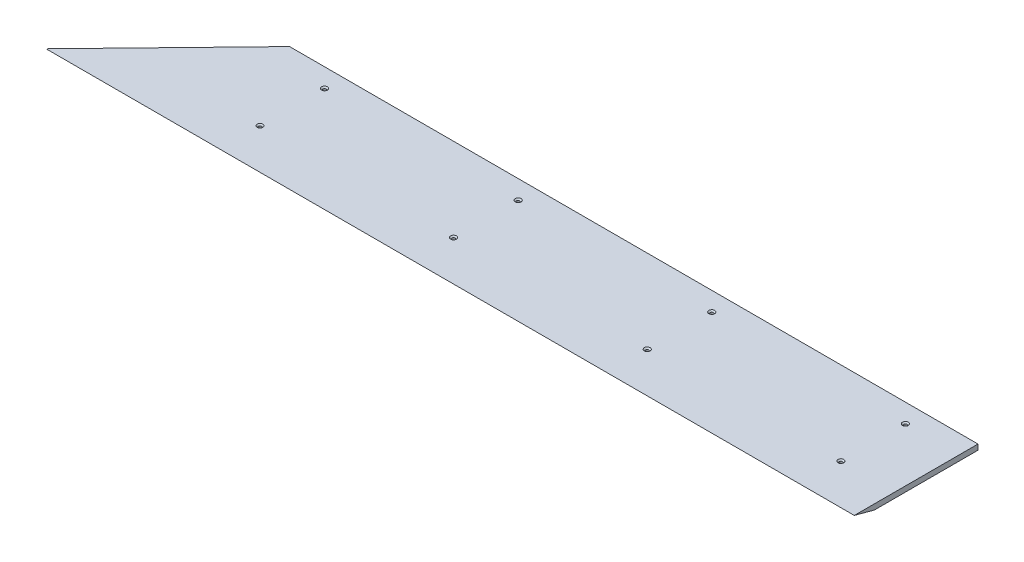
ISO-10303-21;
HEADER;
FILE_DESCRIPTION(('STEP AP214'),'2;1');
FILE_NAME('part.step','',(''),(''),'','','');
FILE_SCHEMA(('AUTOMOTIVE_DESIGN { 1 0 10303 214 1 1 1 1 }'));
ENDSEC;
DATA;
#1=APPLICATION_CONTEXT('core data for automotive mechanical design processes');
#2=APPLICATION_PROTOCOL_DEFINITION('international standard','automotive_design',2000,#1);
#3=PRODUCT_CONTEXT('',#1,'mechanical');
#4=PRODUCT('Part','Part','',(#3));
#5=PRODUCT_RELATED_PRODUCT_CATEGORY('part','',(#4));
#6=PRODUCT_DEFINITION_FORMATION('','',#4);
#7=PRODUCT_DEFINITION_CONTEXT('part definition',#1,'design');
#8=PRODUCT_DEFINITION('design','',#6,#7);
#9=PRODUCT_DEFINITION_SHAPE('','',#8);
#10=(LENGTH_UNIT() NAMED_UNIT(*) SI_UNIT(.MILLI.,.METRE.));
#11=(NAMED_UNIT(*) PLANE_ANGLE_UNIT() SI_UNIT($,.RADIAN.));
#12=(NAMED_UNIT(*) SI_UNIT($,.STERADIAN.) SOLID_ANGLE_UNIT());
#13=UNCERTAINTY_MEASURE_WITH_UNIT(LENGTH_MEASURE(1.E-05),#10,'distance_accuracy_value','');
#14=(GEOMETRIC_REPRESENTATION_CONTEXT(3) GLOBAL_UNCERTAINTY_ASSIGNED_CONTEXT((#13)) GLOBAL_UNIT_ASSIGNED_CONTEXT((#10,
#11,#12)) REPRESENTATION_CONTEXT('',''));
#15=CARTESIAN_POINT('',(0.,0.,0.));
#16=DIRECTION('',(0.,0.,1.));
#17=DIRECTION('',(1.,0.,0.));
#18=AXIS2_PLACEMENT_3D('',#15,#16,#17);
#19=CARTESIAN_POINT('',(685.8,12.7,196.849999999999));
#20=DIRECTION('',(0.,1.,0.));
#21=DIRECTION('',(0.,0.,1.));
#22=AXIS2_PLACEMENT_3D('',#19,#20,#21);
#23=CONICAL_SURFACE('',#22,6.85800000000003,0.872664625997173);
#24=CARTESIAN_POINT('',(685.8,9.94208089623176,196.849999999999));
#25=DIRECTION('',(0.,1.,0.));
#26=DIRECTION('',(0.,0.,1.));
#27=AXIS2_PLACEMENT_3D('',#24,#25,#26);
#28=CIRCLE('',#27,3.57123999999998);
#29=CARTESIAN_POINT('',(685.8,9.94208089623176,200.421239999999));
#30=VERTEX_POINT('',#29);
#31=EDGE_CURVE('E11',#30,#30,#28,.T.);
#32=ORIENTED_EDGE('',*,*,#31,.F.);
#33=EDGE_LOOP('',(#32));
#34=FACE_BOUND('',#33,.T.);
#35=CARTESIAN_POINT('',(685.8,12.7,196.849999999999));
#36=DIRECTION('',(0.,1.,0.));
#37=DIRECTION('',(0.,0.,1.));
#38=AXIS2_PLACEMENT_3D('',#35,#36,#37);
#39=CIRCLE('',#38,6.85800000000003);
#40=CARTESIAN_POINT('',(685.8,12.7,203.707999999999));
#41=VERTEX_POINT('',#40);
#42=EDGE_CURVE('E138',#41,#41,#39,.T.);
#43=ORIENTED_EDGE('',*,*,#42,.T.);
#44=EDGE_LOOP('',(#43));
#45=FACE_BOUND('',#44,.T.);
#46=ADVANCED_FACE('F32',(#34,#45),#23,.F.);
#47=CARTESIAN_POINT('',(685.8,12.7,196.849999999999));
#48=DIRECTION('',(0.,1.,0.));
#49=DIRECTION('',(0.,0.,1.));
#50=AXIS2_PLACEMENT_3D('',#47,#48,#49);
#51=CYLINDRICAL_SURFACE('',#50,3.57123999999998);
#52=CARTESIAN_POINT('',(685.8,0.,196.849999999999));
#53=DIRECTION('',(0.,1.,0.));
#54=DIRECTION('',(0.,0.,1.));
#55=AXIS2_PLACEMENT_3D('',#52,#53,#54);
#56=CIRCLE('',#55,3.57123999999998);
#57=CARTESIAN_POINT('',(685.8,0.,200.421239999999));
#58=VERTEX_POINT('',#57);
#59=EDGE_CURVE('E39',#58,#58,#56,.T.);
#60=ORIENTED_EDGE('',*,*,#59,.F.);
#61=EDGE_LOOP('',(#60));
#62=FACE_BOUND('',#61,.T.);
#63=ORIENTED_EDGE('',*,*,#31,.T.);
#64=EDGE_LOOP('',(#63));
#65=FACE_BOUND('',#64,.T.);
#66=ADVANCED_FACE('F145',(#62,#65),#51,.F.);
#67=CARTESIAN_POINT('',(228.6,12.7,196.85));
#68=DIRECTION('',(0.,1.,0.));
#69=DIRECTION('',(0.,0.,1.));
#70=AXIS2_PLACEMENT_3D('',#67,#68,#69);
#71=CONICAL_SURFACE('',#70,6.85800000000003,0.872664625997173);
#72=CARTESIAN_POINT('',(228.6,9.94208089623176,196.85));
#73=DIRECTION('',(0.,1.,0.));
#74=DIRECTION('',(0.,0.,1.));
#75=AXIS2_PLACEMENT_3D('',#72,#73,#74);
#76=CIRCLE('',#75,3.57123999999998);
#77=CARTESIAN_POINT('',(228.6,9.94208089623176,200.42124));
#78=VERTEX_POINT('',#77);
#79=EDGE_CURVE('E135',#78,#78,#76,.T.);
#80=ORIENTED_EDGE('',*,*,#79,.F.);
#81=EDGE_LOOP('',(#80));
#82=FACE_BOUND('',#81,.T.);
#83=CARTESIAN_POINT('',(228.6,12.7,196.85));
#84=DIRECTION('',(0.,1.,0.));
#85=DIRECTION('',(0.,0.,1.));
#86=AXIS2_PLACEMENT_3D('',#83,#84,#85);
#87=CIRCLE('',#86,6.85800000000003);
#88=CARTESIAN_POINT('',(228.6,12.7,203.708));
#89=VERTEX_POINT('',#88);
#90=EDGE_CURVE('E129',#89,#89,#87,.T.);
#91=ORIENTED_EDGE('',*,*,#90,.T.);
#92=EDGE_LOOP('',(#91));
#93=FACE_BOUND('',#92,.T.);
#94=ADVANCED_FACE('F148',(#82,#93),#71,.F.);
#95=CARTESIAN_POINT('',(228.6,12.7,196.85));
#96=DIRECTION('',(0.,1.,0.));
#97=DIRECTION('',(0.,0.,1.));
#98=AXIS2_PLACEMENT_3D('',#95,#96,#97);
#99=CYLINDRICAL_SURFACE('',#98,3.57123999999998);
#100=CARTESIAN_POINT('',(228.6,0.,196.85));
#101=DIRECTION('',(0.,1.,0.));
#102=DIRECTION('',(0.,0.,1.));
#103=AXIS2_PLACEMENT_3D('',#100,#101,#102);
#104=CIRCLE('',#103,3.57123999999998);
#105=CARTESIAN_POINT('',(228.6,0.,200.42124));
#106=VERTEX_POINT('',#105);
#107=EDGE_CURVE('E132',#106,#106,#104,.T.);
#108=ORIENTED_EDGE('',*,*,#107,.F.);
#109=EDGE_LOOP('',(#108));
#110=FACE_BOUND('',#109,.T.);
#111=ORIENTED_EDGE('',*,*,#79,.T.);
#112=EDGE_LOOP('',(#111));
#113=FACE_BOUND('',#112,.T.);
#114=ADVANCED_FACE('F195',(#110,#113),#99,.F.);
#115=CARTESIAN_POINT('',(685.8,12.7,44.4499999999994));
#116=DIRECTION('',(0.,1.,0.));
#117=DIRECTION('',(0.,0.,1.));
#118=AXIS2_PLACEMENT_3D('',#115,#116,#117);
#119=CONICAL_SURFACE('',#118,6.85800000000003,0.872664625997173);
#120=CARTESIAN_POINT('',(685.8,9.94208089623176,44.4499999999994));
#121=DIRECTION('',(0.,1.,0.));
#122=DIRECTION('',(0.,0.,1.));
#123=AXIS2_PLACEMENT_3D('',#120,#121,#122);
#124=CIRCLE('',#123,3.57123999999998);
#125=CARTESIAN_POINT('',(685.8,9.94208089623176,48.0212399999994));
#126=VERTEX_POINT('',#125);
#127=EDGE_CURVE('E126',#126,#126,#124,.T.);
#128=ORIENTED_EDGE('',*,*,#127,.F.);
#129=EDGE_LOOP('',(#128));
#130=FACE_BOUND('',#129,.T.);
#131=CARTESIAN_POINT('',(685.8,12.7,44.4499999999994));
#132=DIRECTION('',(0.,1.,0.));
#133=DIRECTION('',(0.,0.,1.));
#134=AXIS2_PLACEMENT_3D('',#131,#132,#133);
#135=CIRCLE('',#134,6.85800000000003);
#136=CARTESIAN_POINT('',(685.8,12.7,51.3079999999995));
#137=VERTEX_POINT('',#136);
#138=EDGE_CURVE('E120',#137,#137,#135,.T.);
#139=ORIENTED_EDGE('',*,*,#138,.T.);
#140=EDGE_LOOP('',(#139));
#141=FACE_BOUND('',#140,.T.);
#142=ADVANCED_FACE('F191',(#130,#141),#119,.F.);
#143=CARTESIAN_POINT('',(685.8,12.7,44.4499999999994));
#144=DIRECTION('',(0.,1.,0.));
#145=DIRECTION('',(0.,0.,1.));
#146=AXIS2_PLACEMENT_3D('',#143,#144,#145);
#147=CYLINDRICAL_SURFACE('',#146,3.57123999999998);
#148=CARTESIAN_POINT('',(685.8,0.,44.4499999999994));
#149=DIRECTION('',(0.,1.,0.));
#150=DIRECTION('',(0.,0.,1.));
#151=AXIS2_PLACEMENT_3D('',#148,#149,#150);
#152=CIRCLE('',#151,3.57123999999998);
#153=CARTESIAN_POINT('',(685.8,0.,48.0212399999994));
#154=VERTEX_POINT('',#153);
#155=EDGE_CURVE('E123',#154,#154,#152,.T.);
#156=ORIENTED_EDGE('',*,*,#155,.F.);
#157=EDGE_LOOP('',(#156));
#158=FACE_BOUND('',#157,.T.);
#159=ORIENTED_EDGE('',*,*,#127,.T.);
#160=EDGE_LOOP('',(#159));
#161=FACE_BOUND('',#160,.T.);
#162=ADVANCED_FACE('F187',(#158,#161),#147,.F.);
#163=CARTESIAN_POINT('',(228.6,12.7,44.4499999999995));
#164=DIRECTION('',(0.,1.,0.));
#165=DIRECTION('',(0.,0.,1.));
#166=AXIS2_PLACEMENT_3D('',#163,#164,#165);
#167=CONICAL_SURFACE('',#166,6.85800000000003,0.872664625997173);
#168=CARTESIAN_POINT('',(228.6,9.94208089623176,44.4499999999995));
#169=DIRECTION('',(0.,1.,0.));
#170=DIRECTION('',(0.,0.,1.));
#171=AXIS2_PLACEMENT_3D('',#168,#169,#170);
#172=CIRCLE('',#171,3.57123999999998);
#173=CARTESIAN_POINT('',(228.6,9.94208089623176,48.0212399999995));
#174=VERTEX_POINT('',#173);
#175=EDGE_CURVE('E117',#174,#174,#172,.T.);
#176=ORIENTED_EDGE('',*,*,#175,.F.);
#177=EDGE_LOOP('',(#176));
#178=FACE_BOUND('',#177,.T.);
#179=CARTESIAN_POINT('',(228.6,12.7,44.4499999999995));
#180=DIRECTION('',(0.,1.,0.));
#181=DIRECTION('',(0.,0.,1.));
#182=AXIS2_PLACEMENT_3D('',#179,#180,#181);
#183=CIRCLE('',#182,6.85800000000003);
#184=CARTESIAN_POINT('',(228.6,12.7,51.3079999999995));
#185=VERTEX_POINT('',#184);
#186=EDGE_CURVE('E81',#185,#185,#183,.T.);
#187=ORIENTED_EDGE('',*,*,#186,.T.);
#188=EDGE_LOOP('',(#187));
#189=FACE_BOUND('',#188,.T.);
#190=ADVANCED_FACE('F183',(#178,#189),#167,.F.);
#191=CARTESIAN_POINT('',(228.6,12.7,44.4499999999995));
#192=DIRECTION('',(0.,1.,0.));
#193=DIRECTION('',(0.,0.,1.));
#194=AXIS2_PLACEMENT_3D('',#191,#192,#193);
#195=CYLINDRICAL_SURFACE('',#194,3.57123999999998);
#196=CARTESIAN_POINT('',(228.6,0.,44.4499999999995));
#197=DIRECTION('',(0.,1.,0.));
#198=DIRECTION('',(0.,0.,1.));
#199=AXIS2_PLACEMENT_3D('',#196,#197,#198);
#200=CIRCLE('',#199,3.57123999999998);
#201=CARTESIAN_POINT('',(228.6,0.,48.0212399999995));
#202=VERTEX_POINT('',#201);
#203=EDGE_CURVE('E114',#202,#202,#200,.T.);
#204=ORIENTED_EDGE('',*,*,#203,.F.);
#205=EDGE_LOOP('',(#204));
#206=FACE_BOUND('',#205,.T.);
#207=ORIENTED_EDGE('',*,*,#175,.T.);
#208=EDGE_LOOP('',(#207));
#209=FACE_BOUND('',#208,.T.);
#210=ADVANCED_FACE('F178',(#206,#209),#195,.F.);
#211=CARTESIAN_POINT('',(-1095.86459256231,12.7,292.1));
#212=DIRECTION('',(0.718126297763185,0.,0.695912796592318));
#213=DIRECTION('',(0.695912796592318,0.,-0.718126297763186));
#214=AXIS2_PLACEMENT_3D('',#211,#212,#213);
#215=PLANE('',#214);
#216=DIRECTION('',(-0.695912796592318,0.,0.718126297763185));
#217=VECTOR('',#216,1.);
#218=CARTESIAN_POINT('',(-1095.86459256231,0.,292.1));
#219=LINE('',#218,#217);
#220=CARTESIAN_POINT('',(-812.8,0.,0.));
#221=VERTEX_POINT('',#220);
#222=CARTESIAN_POINT('',(-1049.93366033334,0.,244.702954743876));
#223=VERTEX_POINT('',#222);
#224=EDGE_CURVE('E78',#221,#223,#219,.T.);
#225=ORIENTED_EDGE('',*,*,#224,.T.);
#226=DIRECTION('',(-0.683376443185712,0.188955033292019,0.705189784591678));
#227=VECTOR('',#226,1.);
#228=CARTESIAN_POINT('',(-204.511808803616,-233.760931759521,-627.704719407291));
#229=LINE('',#228,#227);
#230=CARTESIAN_POINT('',(-1095.86459256231,12.7,292.1));
#231=VERTEX_POINT('',#230);
#232=EDGE_CURVE('E73',#223,#231,#229,.T.);
#233=ORIENTED_EDGE('',*,*,#232,.T.);
#234=DIRECTION('',(-0.695912796592318,0.,0.718126297763185));
#235=VECTOR('',#234,1.);
#236=CARTESIAN_POINT('',(-1095.86459256231,12.7,292.1));
#237=LINE('',#236,#235);
#238=CARTESIAN_POINT('',(-812.8,12.7,0.));
#239=VERTEX_POINT('',#238);
#240=EDGE_CURVE('E77',#239,#231,#237,.T.);
#241=ORIENTED_EDGE('',*,*,#240,.F.);
#242=DIRECTION('',(0.,-1.,0.));
#243=VECTOR('',#242,1.);
#244=CARTESIAN_POINT('',(-812.8,12.7,0.));
#245=LINE('',#244,#243);
#246=EDGE_CURVE('E100',#239,#221,#245,.T.);
#247=ORIENTED_EDGE('',*,*,#246,.T.);
#248=EDGE_LOOP('',(#225,#233,#241,#247));
#249=FACE_BOUND('',#248,.T.);
#250=ADVANCED_FACE('F75',(#249),#215,.F.);
#251=CARTESIAN_POINT('',(812.8,12.7,-2.98617875504091E-13));
#252=DIRECTION('',(-1.,0.,0.));
#253=DIRECTION('',(0.,0.,1.));
#254=AXIS2_PLACEMENT_3D('',#251,#252,#253);
#255=PLANE('',#254);
#256=DIRECTION('',(0.,0.,-1.));
#257=VECTOR('',#256,1.);
#258=CARTESIAN_POINT('',(812.8,12.7,-2.98617875504091E-13));
#259=LINE('',#258,#257);
#260=CARTESIAN_POINT('',(812.800000000001,12.7,292.1));
#261=VERTEX_POINT('',#260);
#262=CARTESIAN_POINT('',(812.8,12.7,-2.98617875504091E-13));
#263=VERTEX_POINT('',#262);
#264=EDGE_CURVE('E94',#261,#263,#259,.T.);
#265=ORIENTED_EDGE('',*,*,#264,.F.);
#266=DIRECTION('',(0.,-0.258819045102523,-0.965925826289068));
#267=VECTOR('',#266,1.);
#268=CARTESIAN_POINT('',(812.800000000001,12.7000000000001,292.1));
#269=LINE('',#268,#267);
#270=CARTESIAN_POINT('',(812.800000000001,0.,244.702954743875));
#271=VERTEX_POINT('',#270);
#272=EDGE_CURVE('E54',#261,#271,#269,.T.);
#273=ORIENTED_EDGE('',*,*,#272,.T.);
#274=DIRECTION('',(0.,0.,-1.));
#275=VECTOR('',#274,1.);
#276=CARTESIAN_POINT('',(812.8,0.,-2.98617875504091E-13));
#277=LINE('',#276,#275);
#278=CARTESIAN_POINT('',(812.8,0.,-2.98617875504091E-13));
#279=VERTEX_POINT('',#278);
#280=EDGE_CURVE('E102',#271,#279,#277,.T.);
#281=ORIENTED_EDGE('',*,*,#280,.T.);
#282=DIRECTION('',(0.,-1.,0.));
#283=VECTOR('',#282,1.);
#284=CARTESIAN_POINT('',(812.8,12.7,-2.98617875504091E-13));
#285=LINE('',#284,#283);
#286=EDGE_CURVE('E107',#263,#279,#285,.T.);
#287=ORIENTED_EDGE('',*,*,#286,.F.);
#288=EDGE_LOOP('',(#265,#273,#281,#287));
#289=FACE_BOUND('',#288,.T.);
#290=ADVANCED_FACE('F165',(#289),#255,.F.);
#291=CARTESIAN_POINT('',(-812.8,12.7,0.));
#292=DIRECTION('',(0.,0.,1.));
#293=DIRECTION('',(1.,0.,0.));
#294=AXIS2_PLACEMENT_3D('',#291,#292,#293);
#295=PLANE('',#294);
#296=DIRECTION('',(-1.,0.,0.));
#297=VECTOR('',#296,1.);
#298=CARTESIAN_POINT('',(-812.8,0.,0.));
#299=LINE('',#298,#297);
#300=EDGE_CURVE('E91',#279,#221,#299,.T.);
#301=ORIENTED_EDGE('',*,*,#300,.T.);
#302=ORIENTED_EDGE('',*,*,#246,.F.);
#303=DIRECTION('',(-1.,0.,0.));
#304=VECTOR('',#303,1.);
#305=CARTESIAN_POINT('',(-812.8,12.7,0.));
#306=LINE('',#305,#304);
#307=EDGE_CURVE('E89',#263,#239,#306,.T.);
#308=ORIENTED_EDGE('',*,*,#307,.F.);
#309=ORIENTED_EDGE('',*,*,#286,.T.);
#310=EDGE_LOOP('',(#301,#302,#308,#309));
#311=FACE_BOUND('',#310,.T.);
#312=ADVANCED_FACE('F156',(#311),#295,.F.);
#313=CARTESIAN_POINT('',(0.,12.7,0.));
#314=DIRECTION('',(0.,-1.,0.));
#315=DIRECTION('',(0.,0.,-1.));
#316=AXIS2_PLACEMENT_3D('',#313,#314,#315);
#317=PLANE('',#316);
#318=CARTESIAN_POINT('',(-228.6,12.7,196.85));
#319=DIRECTION('',(0.,1.,0.));
#320=DIRECTION('',(0.,0.,1.));
#321=AXIS2_PLACEMENT_3D('',#318,#319,#320);
#322=CIRCLE('',#321,6.85800000000003);
#323=CARTESIAN_POINT('',(-228.6,12.7,203.708));
#324=VERTEX_POINT('',#323);
#325=EDGE_CURVE('E368',#324,#324,#322,.T.);
#326=ORIENTED_EDGE('',*,*,#325,.F.);
#327=EDGE_LOOP('',(#326));
#328=FACE_BOUND('',#327,.T.);
#329=CARTESIAN_POINT('',(-228.6,12.7,44.4499999999996));
#330=DIRECTION('',(0.,1.,0.));
#331=DIRECTION('',(0.,0.,1.));
#332=AXIS2_PLACEMENT_3D('',#329,#330,#331);
#333=CIRCLE('',#332,6.85800000000003);
#334=CARTESIAN_POINT('',(-228.6,12.7,51.3079999999996));
#335=VERTEX_POINT('',#334);
#336=EDGE_CURVE('E375',#335,#335,#333,.T.);
#337=ORIENTED_EDGE('',*,*,#336,.F.);
#338=EDGE_LOOP('',(#337));
#339=FACE_BOUND('',#338,.T.);
#340=CARTESIAN_POINT('',(-685.8,12.7,44.4499999999997));
#341=DIRECTION('',(0.,1.,0.));
#342=DIRECTION('',(0.,0.,1.));
#343=AXIS2_PLACEMENT_3D('',#340,#341,#342);
#344=CIRCLE('',#343,6.85800000000003);
#345=CARTESIAN_POINT('',(-685.8,12.7,51.3079999999997));
#346=VERTEX_POINT('',#345);
#347=EDGE_CURVE('E384',#346,#346,#344,.T.);
#348=ORIENTED_EDGE('',*,*,#347,.F.);
#349=EDGE_LOOP('',(#348));
#350=FACE_BOUND('',#349,.T.);
#351=CARTESIAN_POINT('',(-685.8,12.7,196.85));
#352=DIRECTION('',(0.,1.,0.));
#353=DIRECTION('',(0.,0.,1.));
#354=AXIS2_PLACEMENT_3D('',#351,#352,#353);
#355=CIRCLE('',#354,6.85800000000003);
#356=CARTESIAN_POINT('',(-685.8,12.7,203.708));
#357=VERTEX_POINT('',#356);
#358=EDGE_CURVE('E393',#357,#357,#355,.T.);
#359=ORIENTED_EDGE('',*,*,#358,.F.);
#360=EDGE_LOOP('',(#359));
#361=FACE_BOUND('',#360,.T.);
#362=ORIENTED_EDGE('',*,*,#240,.T.);
#363=DIRECTION('',(1.,0.,0.));
#364=VECTOR('',#363,1.);
#365=CARTESIAN_POINT('',(812.800000000001,12.7,292.1));
#366=LINE('',#365,#364);
#367=EDGE_CURVE('E87',#231,#261,#366,.T.);
#368=ORIENTED_EDGE('',*,*,#367,.T.);
#369=ORIENTED_EDGE('',*,*,#264,.T.);
#370=ORIENTED_EDGE('',*,*,#307,.T.);
#371=EDGE_LOOP('',(#362,#368,#369,#370));
#372=FACE_BOUND('',#371,.T.);
#373=ORIENTED_EDGE('',*,*,#186,.F.);
#374=EDGE_LOOP('',(#373));
#375=FACE_BOUND('',#374,.T.);
#376=ORIENTED_EDGE('',*,*,#138,.F.);
#377=EDGE_LOOP('',(#376));
#378=FACE_BOUND('',#377,.T.);
#379=ORIENTED_EDGE('',*,*,#90,.F.);
#380=EDGE_LOOP('',(#379));
#381=FACE_BOUND('',#380,.T.);
#382=ORIENTED_EDGE('',*,*,#42,.F.);
#383=EDGE_LOOP('',(#382));
#384=FACE_BOUND('',#383,.T.);
#385=ADVANCED_FACE('F85',(#328,#339,#350,#361,#372,#375,#378,#381,#384),#317,.F.);
#386=CARTESIAN_POINT('',(0.,0.,0.));
#387=DIRECTION('',(0.,-1.,0.));
#388=DIRECTION('',(0.,0.,-1.));
#389=AXIS2_PLACEMENT_3D('',#386,#387,#388);
#390=PLANE('',#389);
#391=CARTESIAN_POINT('',(-228.6,0.,196.85));
#392=DIRECTION('',(0.,1.,0.));
#393=DIRECTION('',(0.,0.,1.));
#394=AXIS2_PLACEMENT_3D('',#391,#392,#393);
#395=CIRCLE('',#394,3.57123999999998);
#396=CARTESIAN_POINT('',(-228.6,0.,200.42124));
#397=VERTEX_POINT('',#396);
#398=EDGE_CURVE('E369',#397,#397,#395,.T.);
#399=ORIENTED_EDGE('',*,*,#398,.T.);
#400=EDGE_LOOP('',(#399));
#401=FACE_BOUND('',#400,.T.);
#402=CARTESIAN_POINT('',(-228.6,0.,44.4499999999996));
#403=DIRECTION('',(0.,1.,0.));
#404=DIRECTION('',(0.,0.,1.));
#405=AXIS2_PLACEMENT_3D('',#402,#403,#404);
#406=CIRCLE('',#405,3.57123999999998);
#407=CARTESIAN_POINT('',(-228.6,0.,48.0212399999996));
#408=VERTEX_POINT('',#407);
#409=EDGE_CURVE('E378',#408,#408,#406,.T.);
#410=ORIENTED_EDGE('',*,*,#409,.T.);
#411=EDGE_LOOP('',(#410));
#412=FACE_BOUND('',#411,.T.);
#413=CARTESIAN_POINT('',(-685.8,0.,44.4499999999997));
#414=DIRECTION('',(0.,1.,0.));
#415=DIRECTION('',(0.,0.,1.));
#416=AXIS2_PLACEMENT_3D('',#413,#414,#415);
#417=CIRCLE('',#416,3.57123999999998);
#418=CARTESIAN_POINT('',(-685.8,0.,48.0212399999997));
#419=VERTEX_POINT('',#418);
#420=EDGE_CURVE('E390',#419,#419,#417,.T.);
#421=ORIENTED_EDGE('',*,*,#420,.T.);
#422=EDGE_LOOP('',(#421));
#423=FACE_BOUND('',#422,.T.);
#424=CARTESIAN_POINT('',(-685.8,0.,196.85));
#425=DIRECTION('',(0.,1.,0.));
#426=DIRECTION('',(0.,0.,1.));
#427=AXIS2_PLACEMENT_3D('',#424,#425,#426);
#428=CIRCLE('',#427,3.57123999999998);
#429=CARTESIAN_POINT('',(-685.8,0.,200.42124));
#430=VERTEX_POINT('',#429);
#431=EDGE_CURVE('E103',#430,#430,#428,.T.);
#432=ORIENTED_EDGE('',*,*,#431,.T.);
#433=EDGE_LOOP('',(#432));
#434=FACE_BOUND('',#433,.T.);
#435=ORIENTED_EDGE('',*,*,#280,.F.);
#436=DIRECTION('',(-1.,0.,0.));
#437=VECTOR('',#436,1.);
#438=CARTESIAN_POINT('',(-1095.86459256231,0.,244.702954743876));
#439=LINE('',#438,#437);
#440=EDGE_CURVE('E46',#271,#223,#439,.T.);
#441=ORIENTED_EDGE('',*,*,#440,.T.);
#442=ORIENTED_EDGE('',*,*,#224,.F.);
#443=ORIENTED_EDGE('',*,*,#300,.F.);
#444=EDGE_LOOP('',(#435,#441,#442,#443));
#445=FACE_BOUND('',#444,.T.);
#446=ORIENTED_EDGE('',*,*,#203,.T.);
#447=EDGE_LOOP('',(#446));
#448=FACE_BOUND('',#447,.T.);
#449=ORIENTED_EDGE('',*,*,#155,.T.);
#450=EDGE_LOOP('',(#449));
#451=FACE_BOUND('',#450,.T.);
#452=ORIENTED_EDGE('',*,*,#107,.T.);
#453=EDGE_LOOP('',(#452));
#454=FACE_BOUND('',#453,.T.);
#455=ORIENTED_EDGE('',*,*,#59,.T.);
#456=EDGE_LOOP('',(#455));
#457=FACE_BOUND('',#456,.T.);
#458=ADVANCED_FACE('F143',(#401,#412,#423,#434,#445,#448,#451,#454,#457),#390,.T.);
#459=CARTESIAN_POINT('',(812.800000000001,12.7000000000001,292.1));
#460=DIRECTION('',(0.,-0.965925826289068,0.258819045102523));
#461=DIRECTION('',(-1.,0.,0.));
#462=AXIS2_PLACEMENT_3D('',#459,#460,#461);
#463=PLANE('',#462);
#464=ORIENTED_EDGE('',*,*,#232,.F.);
#465=ORIENTED_EDGE('',*,*,#440,.F.);
#466=ORIENTED_EDGE('',*,*,#272,.F.);
#467=ORIENTED_EDGE('',*,*,#367,.F.);
#468=EDGE_LOOP('',(#464,#465,#466,#467));
#469=FACE_BOUND('',#468,.T.);
#470=ADVANCED_FACE('F93',(#469),#463,.T.);
#471=CARTESIAN_POINT('',(-685.8,12.7,196.85));
#472=DIRECTION('',(0.,1.,0.));
#473=DIRECTION('',(0.,0.,1.));
#474=AXIS2_PLACEMENT_3D('',#471,#472,#473);
#475=CYLINDRICAL_SURFACE('',#474,3.57123999999998);
#476=ORIENTED_EDGE('',*,*,#431,.F.);
#477=EDGE_LOOP('',(#476));
#478=FACE_BOUND('',#477,.T.);
#479=CARTESIAN_POINT('',(-685.8,9.94208089623176,196.85));
#480=DIRECTION('',(0.,1.,0.));
#481=DIRECTION('',(0.,0.,1.));
#482=AXIS2_PLACEMENT_3D('',#479,#480,#481);
#483=CIRCLE('',#482,3.57123999999998);
#484=CARTESIAN_POINT('',(-685.8,9.94208089623176,200.42124));
#485=VERTEX_POINT('',#484);
#486=EDGE_CURVE('E396',#485,#485,#483,.T.);
#487=ORIENTED_EDGE('',*,*,#486,.T.);
#488=EDGE_LOOP('',(#487));
#489=FACE_BOUND('',#488,.T.);
#490=ADVANCED_FACE('F171',(#478,#489),#475,.F.);
#491=CARTESIAN_POINT('',(-685.8,12.7,196.85));
#492=DIRECTION('',(0.,1.,0.));
#493=DIRECTION('',(0.,0.,1.));
#494=AXIS2_PLACEMENT_3D('',#491,#492,#493);
#495=CONICAL_SURFACE('',#494,6.85800000000003,0.872664625997173);
#496=ORIENTED_EDGE('',*,*,#486,.F.);
#497=EDGE_LOOP('',(#496));
#498=FACE_BOUND('',#497,.T.);
#499=ORIENTED_EDGE('',*,*,#358,.T.);
#500=EDGE_LOOP('',(#499));
#501=FACE_BOUND('',#500,.T.);
#502=ADVANCED_FACE('F270',(#498,#501),#495,.F.);
#503=CARTESIAN_POINT('',(-685.8,12.7,44.4499999999997));
#504=DIRECTION('',(0.,1.,0.));
#505=DIRECTION('',(0.,0.,1.));
#506=AXIS2_PLACEMENT_3D('',#503,#504,#505);
#507=CYLINDRICAL_SURFACE('',#506,3.57123999999998);
#508=ORIENTED_EDGE('',*,*,#420,.F.);
#509=EDGE_LOOP('',(#508));
#510=FACE_BOUND('',#509,.T.);
#511=CARTESIAN_POINT('',(-685.8,9.94208089623176,44.4499999999997));
#512=DIRECTION('',(0.,1.,0.));
#513=DIRECTION('',(0.,0.,1.));
#514=AXIS2_PLACEMENT_3D('',#511,#512,#513);
#515=CIRCLE('',#514,3.57123999999998);
#516=CARTESIAN_POINT('',(-685.8,9.94208089623176,48.0212399999997));
#517=VERTEX_POINT('',#516);
#518=EDGE_CURVE('E387',#517,#517,#515,.T.);
#519=ORIENTED_EDGE('',*,*,#518,.T.);
#520=EDGE_LOOP('',(#519));
#521=FACE_BOUND('',#520,.T.);
#522=ADVANCED_FACE('F278',(#510,#521),#507,.F.);
#523=CARTESIAN_POINT('',(-685.8,12.7,44.4499999999997));
#524=DIRECTION('',(0.,1.,0.));
#525=DIRECTION('',(0.,0.,1.));
#526=AXIS2_PLACEMENT_3D('',#523,#524,#525);
#527=CONICAL_SURFACE('',#526,6.85800000000003,0.872664625997173);
#528=ORIENTED_EDGE('',*,*,#518,.F.);
#529=EDGE_LOOP('',(#528));
#530=FACE_BOUND('',#529,.T.);
#531=ORIENTED_EDGE('',*,*,#347,.T.);
#532=EDGE_LOOP('',(#531));
#533=FACE_BOUND('',#532,.T.);
#534=ADVANCED_FACE('F286',(#530,#533),#527,.F.);
#535=CARTESIAN_POINT('',(-228.6,12.7,44.4499999999996));
#536=DIRECTION('',(0.,1.,0.));
#537=DIRECTION('',(0.,0.,1.));
#538=AXIS2_PLACEMENT_3D('',#535,#536,#537);
#539=CYLINDRICAL_SURFACE('',#538,3.57123999999998);
#540=ORIENTED_EDGE('',*,*,#409,.F.);
#541=EDGE_LOOP('',(#540));
#542=FACE_BOUND('',#541,.T.);
#543=CARTESIAN_POINT('',(-228.6,9.94208089623176,44.4499999999996));
#544=DIRECTION('',(0.,1.,0.));
#545=DIRECTION('',(0.,0.,1.));
#546=AXIS2_PLACEMENT_3D('',#543,#544,#545);
#547=CIRCLE('',#546,3.57123999999998);
#548=CARTESIAN_POINT('',(-228.6,9.94208089623176,48.0212399999996));
#549=VERTEX_POINT('',#548);
#550=EDGE_CURVE('E381',#549,#549,#547,.T.);
#551=ORIENTED_EDGE('',*,*,#550,.T.);
#552=EDGE_LOOP('',(#551));
#553=FACE_BOUND('',#552,.T.);
#554=ADVANCED_FACE('F295',(#542,#553),#539,.F.);
#555=CARTESIAN_POINT('',(-228.6,12.7,44.4499999999996));
#556=DIRECTION('',(0.,1.,0.));
#557=DIRECTION('',(0.,0.,1.));
#558=AXIS2_PLACEMENT_3D('',#555,#556,#557);
#559=CONICAL_SURFACE('',#558,6.85800000000003,0.872664625997173);
#560=ORIENTED_EDGE('',*,*,#550,.F.);
#561=EDGE_LOOP('',(#560));
#562=FACE_BOUND('',#561,.T.);
#563=ORIENTED_EDGE('',*,*,#336,.T.);
#564=EDGE_LOOP('',(#563));
#565=FACE_BOUND('',#564,.T.);
#566=ADVANCED_FACE('F324',(#562,#565),#559,.F.);
#567=CARTESIAN_POINT('',(-228.6,12.7,196.85));
#568=DIRECTION('',(0.,1.,0.));
#569=DIRECTION('',(0.,0.,1.));
#570=AXIS2_PLACEMENT_3D('',#567,#568,#569);
#571=CYLINDRICAL_SURFACE('',#570,3.57123999999998);
#572=ORIENTED_EDGE('',*,*,#398,.F.);
#573=EDGE_LOOP('',(#572));
#574=FACE_BOUND('',#573,.T.);
#575=CARTESIAN_POINT('',(-228.6,9.94208089623176,196.85));
#576=DIRECTION('',(0.,1.,0.));
#577=DIRECTION('',(0.,0.,1.));
#578=AXIS2_PLACEMENT_3D('',#575,#576,#577);
#579=CIRCLE('',#578,3.57123999999998);
#580=CARTESIAN_POINT('',(-228.6,9.94208089623176,200.42124));
#581=VERTEX_POINT('',#580);
#582=EDGE_CURVE('E366',#581,#581,#579,.T.);
#583=ORIENTED_EDGE('',*,*,#582,.T.);
#584=EDGE_LOOP('',(#583));
#585=FACE_BOUND('',#584,.T.);
#586=ADVANCED_FACE('F333',(#574,#585),#571,.F.);
#587=CARTESIAN_POINT('',(-228.6,12.7,196.85));
#588=DIRECTION('',(0.,1.,0.));
#589=DIRECTION('',(0.,0.,1.));
#590=AXIS2_PLACEMENT_3D('',#587,#588,#589);
#591=CONICAL_SURFACE('',#590,6.85800000000003,0.872664625997173);
#592=ORIENTED_EDGE('',*,*,#582,.F.);
#593=EDGE_LOOP('',(#592));
#594=FACE_BOUND('',#593,.T.);
#595=ORIENTED_EDGE('',*,*,#325,.T.);
#596=EDGE_LOOP('',(#595));
#597=FACE_BOUND('',#596,.T.);
#598=ADVANCED_FACE('F342',(#594,#597),#591,.F.);
#599=CLOSED_SHELL('',(#46,#66,#94,#114,#142,#162,#190,#210,#250,#290,#312,#385,#458,#470,#490,
#502,#522,#534,#554,#566,#586,#598));
#600=MANIFOLD_SOLID_BREP('B2',#599);
#601=ADVANCED_BREP_SHAPE_REPRESENTATION('',(#18,#600),#14);
#602=SHAPE_DEFINITION_REPRESENTATION(#9,#601);
ENDSEC;
END-ISO-10303-21;
